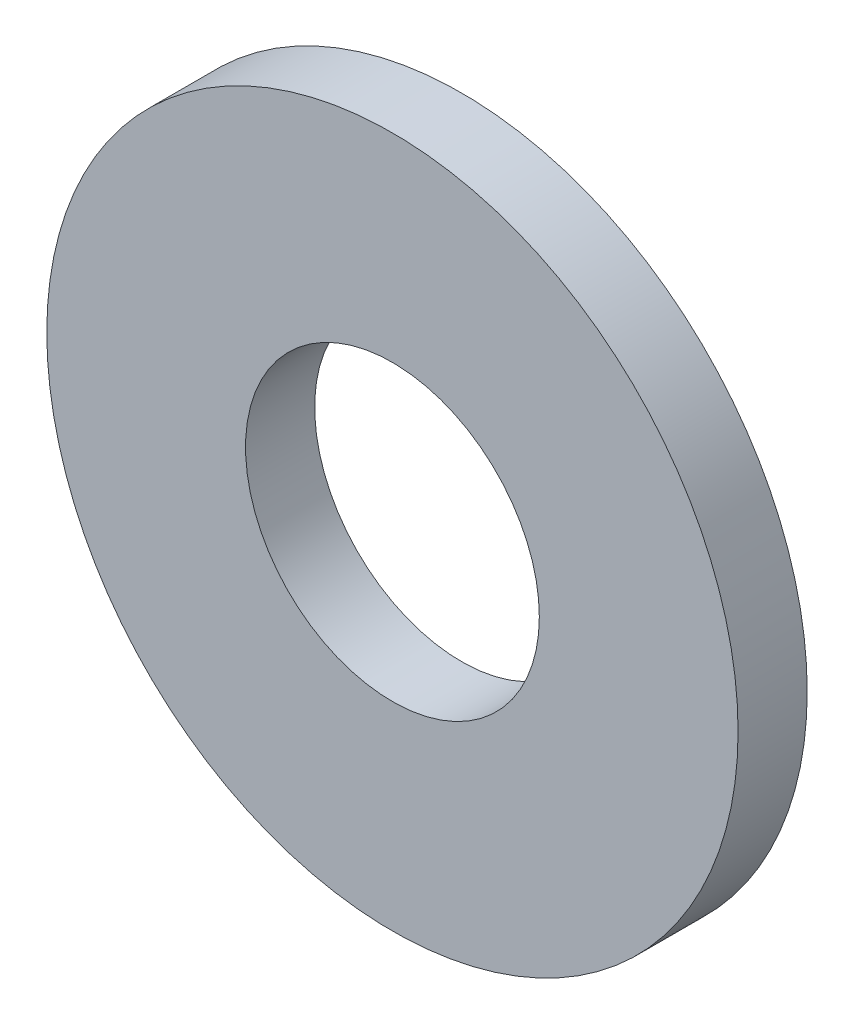
ISO-10303-21;
HEADER;
FILE_DESCRIPTION(('STEP AP214'),'2;1');
FILE_NAME('part.step','',(''),(''),'','','');
FILE_SCHEMA(('AUTOMOTIVE_DESIGN { 1 0 10303 214 1 1 1 1 }'));
ENDSEC;
DATA;
#1=APPLICATION_CONTEXT('core data for automotive mechanical design processes');
#2=APPLICATION_PROTOCOL_DEFINITION('international standard','automotive_design',2000,#1);
#3=PRODUCT_CONTEXT('',#1,'mechanical');
#4=PRODUCT('Part','Part','',(#3));
#5=PRODUCT_RELATED_PRODUCT_CATEGORY('part','',(#4));
#6=PRODUCT_DEFINITION_FORMATION('','',#4);
#7=PRODUCT_DEFINITION_CONTEXT('part definition',#1,'design');
#8=PRODUCT_DEFINITION('design','',#6,#7);
#9=PRODUCT_DEFINITION_SHAPE('','',#8);
#10=(LENGTH_UNIT() NAMED_UNIT(*) SI_UNIT(.MILLI.,.METRE.));
#11=(NAMED_UNIT(*) PLANE_ANGLE_UNIT() SI_UNIT($,.RADIAN.));
#12=(NAMED_UNIT(*) SI_UNIT($,.STERADIAN.) SOLID_ANGLE_UNIT());
#13=UNCERTAINTY_MEASURE_WITH_UNIT(LENGTH_MEASURE(1.E-05),#10,'distance_accuracy_value','');
#14=(GEOMETRIC_REPRESENTATION_CONTEXT(3) GLOBAL_UNCERTAINTY_ASSIGNED_CONTEXT((#13)) GLOBAL_UNIT_ASSIGNED_CONTEXT((#10,
#11,#12)) REPRESENTATION_CONTEXT('',''));
#15=CARTESIAN_POINT('',(0.,0.,0.));
#16=DIRECTION('',(0.,0.,1.));
#17=DIRECTION('',(1.,0.,0.));
#18=AXIS2_PLACEMENT_3D('',#15,#16,#17);
#19=CARTESIAN_POINT('',(0.,0.,0.4));
#20=DIRECTION('',(0.,0.,1.));
#21=DIRECTION('',(1.,0.,0.));
#22=AXIS2_PLACEMENT_3D('',#19,#20,#21);
#23=PLANE('',#22);
#24=CARTESIAN_POINT('',(0.,0.,0.4));
#25=DIRECTION('',(0.,0.,1.));
#26=DIRECTION('',(1.,0.,0.));
#27=AXIS2_PLACEMENT_3D('',#24,#25,#26);
#28=CIRCLE('',#27,2.);
#29=CARTESIAN_POINT('',(2.,0.,0.4));
#30=VERTEX_POINT('',#29);
#31=EDGE_CURVE('E10',#30,#30,#28,.T.);
#32=ORIENTED_EDGE('',*,*,#31,.T.);
#33=EDGE_LOOP('',(#32));
#34=FACE_BOUND('',#33,.T.);
#35=CARTESIAN_POINT('',(0.,0.,0.4));
#36=DIRECTION('',(0.,0.,1.));
#37=DIRECTION('',(1.,0.,0.));
#38=AXIS2_PLACEMENT_3D('',#35,#36,#37);
#39=CIRCLE('',#38,0.85);
#40=CARTESIAN_POINT('',(0.85,0.,0.4));
#41=VERTEX_POINT('',#40);
#42=EDGE_CURVE('E45',#41,#41,#39,.T.);
#43=ORIENTED_EDGE('',*,*,#42,.F.);
#44=EDGE_LOOP('',(#43));
#45=FACE_BOUND('',#44,.T.);
#46=ADVANCED_FACE('F34',(#34,#45),#23,.T.);
#47=CARTESIAN_POINT('',(0.,0.,0.));
#48=DIRECTION('',(0.,0.,1.));
#49=DIRECTION('',(1.,0.,0.));
#50=AXIS2_PLACEMENT_3D('',#47,#48,#49);
#51=PLANE('',#50);
#52=CARTESIAN_POINT('',(0.,0.,0.));
#53=DIRECTION('',(0.,0.,1.));
#54=DIRECTION('',(1.,0.,0.));
#55=AXIS2_PLACEMENT_3D('',#52,#53,#54);
#56=CIRCLE('',#55,2.);
#57=CARTESIAN_POINT('',(2.,0.,0.));
#58=VERTEX_POINT('',#57);
#59=EDGE_CURVE('E38',#58,#58,#56,.T.);
#60=ORIENTED_EDGE('',*,*,#59,.F.);
#61=EDGE_LOOP('',(#60));
#62=FACE_BOUND('',#61,.T.);
#63=CARTESIAN_POINT('',(0.,0.,0.));
#64=DIRECTION('',(0.,0.,1.));
#65=DIRECTION('',(1.,0.,0.));
#66=AXIS2_PLACEMENT_3D('',#63,#64,#65);
#67=CIRCLE('',#66,0.85);
#68=CARTESIAN_POINT('',(0.85,0.,0.));
#69=VERTEX_POINT('',#68);
#70=EDGE_CURVE('E47',#69,#69,#67,.T.);
#71=ORIENTED_EDGE('',*,*,#70,.T.);
#72=EDGE_LOOP('',(#71));
#73=FACE_BOUND('',#72,.T.);
#74=ADVANCED_FACE('F57',(#62,#73),#51,.F.);
#75=CARTESIAN_POINT('',(0.,0.,0.4));
#76=DIRECTION('',(0.,0.,-1.));
#77=DIRECTION('',(-1.,0.,0.));
#78=AXIS2_PLACEMENT_3D('',#75,#76,#77);
#79=CYLINDRICAL_SURFACE('',#78,2.);
#80=ORIENTED_EDGE('',*,*,#31,.F.);
#81=EDGE_LOOP('',(#80));
#82=FACE_BOUND('',#81,.T.);
#83=ORIENTED_EDGE('',*,*,#59,.T.);
#84=EDGE_LOOP('',(#83));
#85=FACE_BOUND('',#84,.T.);
#86=ADVANCED_FACE('F36',(#82,#85),#79,.T.);
#87=CARTESIAN_POINT('',(0.,0.,0.4));
#88=DIRECTION('',(0.,0.,-1.));
#89=DIRECTION('',(-1.,0.,0.));
#90=AXIS2_PLACEMENT_3D('',#87,#88,#89);
#91=CYLINDRICAL_SURFACE('',#90,0.85);
#92=ORIENTED_EDGE('',*,*,#42,.T.);
#93=EDGE_LOOP('',(#92));
#94=FACE_BOUND('',#93,.T.);
#95=ORIENTED_EDGE('',*,*,#70,.F.);
#96=EDGE_LOOP('',(#95));
#97=FACE_BOUND('',#96,.T.);
#98=ADVANCED_FACE('F53',(#94,#97),#91,.F.);
#99=CLOSED_SHELL('',(#46,#74,#86,#98));
#100=MANIFOLD_SOLID_BREP('B2',#99);
#101=ADVANCED_BREP_SHAPE_REPRESENTATION('',(#18,#100),#14);
#102=SHAPE_DEFINITION_REPRESENTATION(#9,#101);
ENDSEC;
END-ISO-10303-21;
